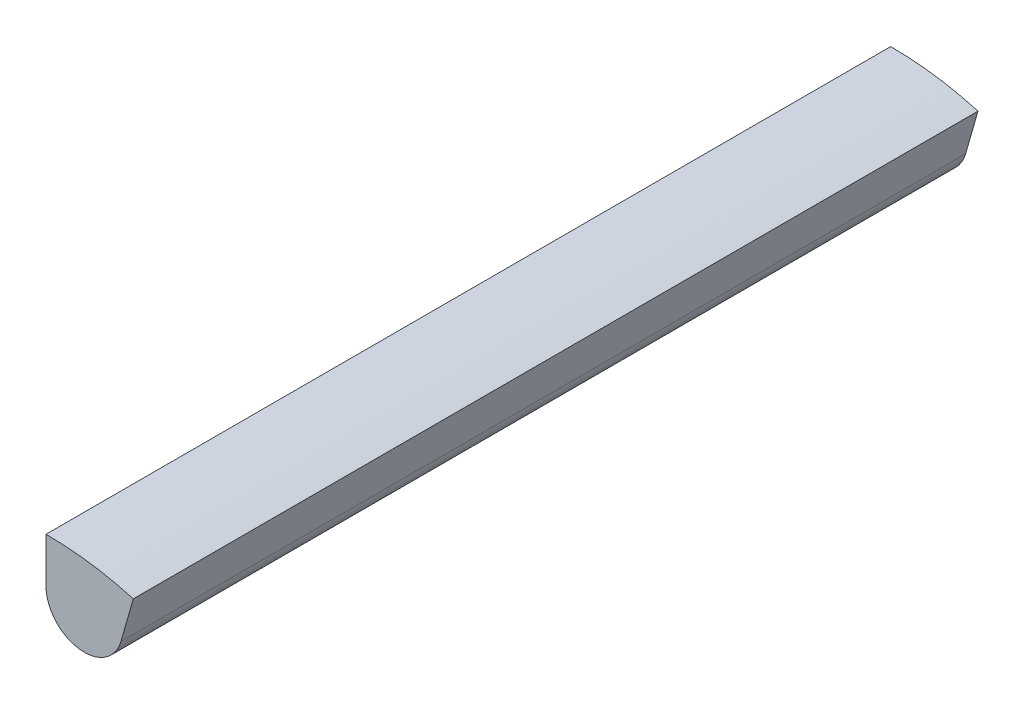
ISO-10303-21;
HEADER;
FILE_DESCRIPTION(('STEP AP214'),'2;1');
FILE_NAME('part.step','',(''),(''),'','','');
FILE_SCHEMA(('AUTOMOTIVE_DESIGN { 1 0 10303 214 1 1 1 1 }'));
ENDSEC;
DATA;
#1=APPLICATION_CONTEXT('core data for automotive mechanical design processes');
#2=APPLICATION_PROTOCOL_DEFINITION('international standard','automotive_design',2000,#1);
#3=PRODUCT_CONTEXT('',#1,'mechanical');
#4=PRODUCT('Part','Part','',(#3));
#5=PRODUCT_RELATED_PRODUCT_CATEGORY('part','',(#4));
#6=PRODUCT_DEFINITION_FORMATION('','',#4);
#7=PRODUCT_DEFINITION_CONTEXT('part definition',#1,'design');
#8=PRODUCT_DEFINITION('design','',#6,#7);
#9=PRODUCT_DEFINITION_SHAPE('','',#8);
#10=(LENGTH_UNIT() NAMED_UNIT(*) SI_UNIT(.MILLI.,.METRE.));
#11=(NAMED_UNIT(*) PLANE_ANGLE_UNIT() SI_UNIT($,.RADIAN.));
#12=(NAMED_UNIT(*) SI_UNIT($,.STERADIAN.) SOLID_ANGLE_UNIT());
#13=UNCERTAINTY_MEASURE_WITH_UNIT(LENGTH_MEASURE(1.E-05),#10,'distance_accuracy_value','');
#14=(GEOMETRIC_REPRESENTATION_CONTEXT(3) GLOBAL_UNCERTAINTY_ASSIGNED_CONTEXT((#13)) GLOBAL_UNIT_ASSIGNED_CONTEXT((#10,
#11,#12)) REPRESENTATION_CONTEXT('',''));
#15=CARTESIAN_POINT('',(0.,0.,0.));
#16=DIRECTION('',(0.,0.,1.));
#17=DIRECTION('',(1.,0.,0.));
#18=AXIS2_PLACEMENT_3D('',#15,#16,#17);
#19=CARTESIAN_POINT('',(4.52312578120214,32.183712234101,100.));
#20=DIRECTION('',(0.,0.,-1.));
#21=DIRECTION('',(-1.,0.,0.));
#22=AXIS2_PLACEMENT_3D('',#19,#20,#21);
#23=CYLINDRICAL_SURFACE('',#22,4.52312578120214);
#24=CARTESIAN_POINT('',(4.52312578120214,32.183712234101,0.));
#25=DIRECTION('',(0.,0.,1.));
#26=DIRECTION('',(1.,0.,0.));
#27=AXIS2_PLACEMENT_3D('',#24,#25,#26);
#28=CIRCLE('',#27,4.52312578120214);
#29=CARTESIAN_POINT('',(0.,32.183712234101,0.));
#30=VERTEX_POINT('',#29);
#31=CARTESIAN_POINT('',(8.87103334058284,30.9369698037428,0.));
#32=VERTEX_POINT('',#31);
#33=EDGE_CURVE('E109',#30,#32,#28,.T.);
#34=ORIENTED_EDGE('',*,*,#33,.T.);
#35=DIRECTION('',(0.,0.,-1.));
#36=VECTOR('',#35,1.);
#37=CARTESIAN_POINT('',(8.87103334058284,30.9369698037428,100.));
#38=LINE('',#37,#36);
#39=CARTESIAN_POINT('',(8.87103334058284,30.9369698037428,100.));
#40=VERTEX_POINT('',#39);
#41=EDGE_CURVE('E11',#40,#32,#38,.T.);
#42=ORIENTED_EDGE('',*,*,#41,.F.);
#43=CARTESIAN_POINT('',(4.52312578120214,32.183712234101,100.));
#44=DIRECTION('',(0.,0.,1.));
#45=DIRECTION('',(1.,0.,0.));
#46=AXIS2_PLACEMENT_3D('',#43,#44,#45);
#47=CIRCLE('',#46,4.52312578120214);
#48=CARTESIAN_POINT('',(0.,32.183712234101,100.));
#49=VERTEX_POINT('',#48);
#50=EDGE_CURVE('E91',#49,#40,#47,.T.);
#51=ORIENTED_EDGE('',*,*,#50,.F.);
#52=DIRECTION('',(0.,0.,-1.));
#53=VECTOR('',#52,1.);
#54=CARTESIAN_POINT('',(0.,32.183712234101,100.));
#55=LINE('',#54,#53);
#56=EDGE_CURVE('E58',#49,#30,#55,.T.);
#57=ORIENTED_EDGE('',*,*,#56,.T.);
#58=EDGE_LOOP('',(#34,#42,#51,#57));
#59=FACE_BOUND('',#58,.T.);
#60=ADVANCED_FACE('F41',(#59),#23,.T.);
#61=CARTESIAN_POINT('',(0.,0.,100.));
#62=DIRECTION('',(-0.961261695938319,0.275637355817,0.));
#63=DIRECTION('',(-0.275637355817,-0.961261695938319,0.));
#64=AXIS2_PLACEMENT_3D('',#61,#62,#63);
#65=PLANE('',#64);
#66=DIRECTION('',(0.275637355817,0.961261695938319,0.));
#67=VECTOR('',#66,1.);
#68=CARTESIAN_POINT('',(0.,0.,0.));
#69=LINE('',#68,#67);
#70=CARTESIAN_POINT('',(10.3364008431375,36.047313597687,0.));
#71=VERTEX_POINT('',#70);
#72=EDGE_CURVE('E97',#32,#71,#69,.T.);
#73=ORIENTED_EDGE('',*,*,#72,.T.);
#74=DIRECTION('',(0.,0.,-1.));
#75=VECTOR('',#74,1.);
#76=CARTESIAN_POINT('',(10.3364008431375,36.047313597687,100.));
#77=LINE('',#76,#75);
#78=CARTESIAN_POINT('',(10.3364008431375,36.047313597687,100.));
#79=VERTEX_POINT('',#78);
#80=EDGE_CURVE('E50',#79,#71,#77,.T.);
#81=ORIENTED_EDGE('',*,*,#80,.F.);
#82=DIRECTION('',(0.275637355817,0.961261695938319,0.));
#83=VECTOR('',#82,1.);
#84=CARTESIAN_POINT('',(0.,0.,100.));
#85=LINE('',#84,#83);
#86=EDGE_CURVE('E84',#40,#79,#85,.T.);
#87=ORIENTED_EDGE('',*,*,#86,.F.);
#88=ORIENTED_EDGE('',*,*,#41,.T.);
#89=EDGE_LOOP('',(#73,#81,#87,#88));
#90=FACE_BOUND('',#89,.T.);
#91=ADVANCED_FACE('F96',(#90),#65,.F.);
#92=CARTESIAN_POINT('',(0.,0.,100.));
#93=DIRECTION('',(0.,0.,-1.));
#94=DIRECTION('',(-1.,0.,0.));
#95=AXIS2_PLACEMENT_3D('',#92,#93,#94);
#96=CYLINDRICAL_SURFACE('',#95,37.5);
#97=CARTESIAN_POINT('',(0.,0.,0.));
#98=DIRECTION('',(0.,0.,1.));
#99=DIRECTION('',(1.,0.,0.));
#100=AXIS2_PLACEMENT_3D('',#97,#98,#99);
#101=CIRCLE('',#100,37.5);
#102=CARTESIAN_POINT('',(0.,37.5,0.));
#103=VERTEX_POINT('',#102);
#104=EDGE_CURVE('E114',#71,#103,#101,.T.);
#105=ORIENTED_EDGE('',*,*,#104,.T.);
#106=DIRECTION('',(0.,0.,-1.));
#107=VECTOR('',#106,1.);
#108=CARTESIAN_POINT('',(0.,37.5,100.));
#109=LINE('',#108,#107);
#110=CARTESIAN_POINT('',(0.,37.5,100.));
#111=VERTEX_POINT('',#110);
#112=EDGE_CURVE('E73',#111,#103,#109,.T.);
#113=ORIENTED_EDGE('',*,*,#112,.F.);
#114=CARTESIAN_POINT('',(0.,0.,100.));
#115=DIRECTION('',(0.,0.,1.));
#116=DIRECTION('',(1.,0.,0.));
#117=AXIS2_PLACEMENT_3D('',#114,#115,#116);
#118=CIRCLE('',#117,37.5);
#119=EDGE_CURVE('E90',#79,#111,#118,.T.);
#120=ORIENTED_EDGE('',*,*,#119,.F.);
#121=ORIENTED_EDGE('',*,*,#80,.T.);
#122=EDGE_LOOP('',(#105,#113,#120,#121));
#123=FACE_BOUND('',#122,.T.);
#124=ADVANCED_FACE('F101',(#123),#96,.T.);
#125=CARTESIAN_POINT('',(0.,0.,100.));
#126=DIRECTION('',(-1.,0.,0.));
#127=DIRECTION('',(0.,0.,1.));
#128=AXIS2_PLACEMENT_3D('',#125,#126,#127);
#129=PLANE('',#128);
#130=DIRECTION('',(0.,1.,0.));
#131=VECTOR('',#130,1.);
#132=CARTESIAN_POINT('',(0.,0.,0.));
#133=LINE('',#132,#131);
#134=EDGE_CURVE('E117',#30,#103,#133,.T.);
#135=ORIENTED_EDGE('',*,*,#134,.F.);
#136=ORIENTED_EDGE('',*,*,#56,.F.);
#137=DIRECTION('',(0.,1.,0.));
#138=VECTOR('',#137,1.);
#139=CARTESIAN_POINT('',(0.,0.,100.));
#140=LINE('',#139,#138);
#141=EDGE_CURVE('E103',#49,#111,#140,.T.);
#142=ORIENTED_EDGE('',*,*,#141,.T.);
#143=ORIENTED_EDGE('',*,*,#112,.T.);
#144=EDGE_LOOP('',(#135,#136,#142,#143));
#145=FACE_BOUND('',#144,.T.);
#146=ADVANCED_FACE('F127',(#145),#129,.T.);
#147=CARTESIAN_POINT('',(0.,0.,100.));
#148=DIRECTION('',(0.,0.,1.));
#149=DIRECTION('',(1.,0.,0.));
#150=AXIS2_PLACEMENT_3D('',#147,#148,#149);
#151=PLANE('',#150);
#152=ORIENTED_EDGE('',*,*,#50,.T.);
#153=ORIENTED_EDGE('',*,*,#86,.T.);
#154=ORIENTED_EDGE('',*,*,#119,.T.);
#155=ORIENTED_EDGE('',*,*,#141,.F.);
#156=EDGE_LOOP('',(#152,#153,#154,#155));
#157=FACE_BOUND('',#156,.T.);
#158=ADVANCED_FACE('F87',(#157),#151,.T.);
#159=CARTESIAN_POINT('',(0.,0.,0.));
#160=DIRECTION('',(0.,0.,1.));
#161=DIRECTION('',(1.,0.,0.));
#162=AXIS2_PLACEMENT_3D('',#159,#160,#161);
#163=PLANE('',#162);
#164=ORIENTED_EDGE('',*,*,#33,.F.);
#165=ORIENTED_EDGE('',*,*,#134,.T.);
#166=ORIENTED_EDGE('',*,*,#104,.F.);
#167=ORIENTED_EDGE('',*,*,#72,.F.);
#168=EDGE_LOOP('',(#164,#165,#166,#167));
#169=FACE_BOUND('',#168,.T.);
#170=ADVANCED_FACE('F126',(#169),#163,.F.);
#171=CLOSED_SHELL('',(#60,#91,#124,#146,#158,#170));
#172=MANIFOLD_SOLID_BREP('B2',#171);
#173=ADVANCED_BREP_SHAPE_REPRESENTATION('',(#18,#172),#14);
#174=SHAPE_DEFINITION_REPRESENTATION(#9,#173);
ENDSEC;
END-ISO-10303-21;
